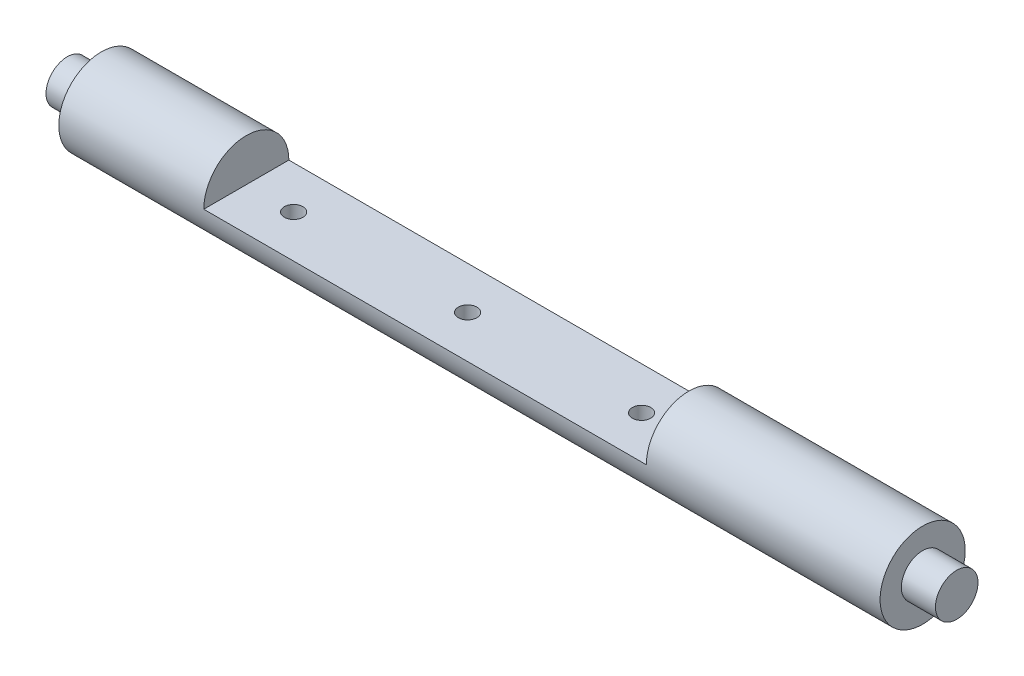
ISO-10303-21;
HEADER;
FILE_DESCRIPTION(('STEP AP214'),'2;1');
FILE_NAME('part.step','',(''),(''),'','','');
FILE_SCHEMA(('AUTOMOTIVE_DESIGN { 1 0 10303 214 1 1 1 1 }'));
ENDSEC;
DATA;
#1=APPLICATION_CONTEXT('core data for automotive mechanical design processes');
#2=APPLICATION_PROTOCOL_DEFINITION('international standard','automotive_design',2000,#1);
#3=PRODUCT_CONTEXT('',#1,'mechanical');
#4=PRODUCT('Part','Part','',(#3));
#5=PRODUCT_RELATED_PRODUCT_CATEGORY('part','',(#4));
#6=PRODUCT_DEFINITION_FORMATION('','',#4);
#7=PRODUCT_DEFINITION_CONTEXT('part definition',#1,'design');
#8=PRODUCT_DEFINITION('design','',#6,#7);
#9=PRODUCT_DEFINITION_SHAPE('','',#8);
#10=(LENGTH_UNIT() NAMED_UNIT(*) SI_UNIT(.MILLI.,.METRE.));
#11=(NAMED_UNIT(*) PLANE_ANGLE_UNIT() SI_UNIT($,.RADIAN.));
#12=(NAMED_UNIT(*) SI_UNIT($,.STERADIAN.) SOLID_ANGLE_UNIT());
#13=UNCERTAINTY_MEASURE_WITH_UNIT(LENGTH_MEASURE(1.E-05),#10,'distance_accuracy_value','');
#14=(GEOMETRIC_REPRESENTATION_CONTEXT(3) GLOBAL_UNCERTAINTY_ASSIGNED_CONTEXT((#13)) GLOBAL_UNIT_ASSIGNED_CONTEXT((#10,
#11,#12)) REPRESENTATION_CONTEXT('',''));
#15=CARTESIAN_POINT('',(0.,0.,0.));
#16=DIRECTION('',(0.,0.,1.));
#17=DIRECTION('',(1.,0.,0.));
#18=AXIS2_PLACEMENT_3D('',#15,#16,#17);
#19=CARTESIAN_POINT('',(76.581,0.,0.));
#20=DIRECTION('',(-1.,0.,0.));
#21=DIRECTION('',(0.,0.,1.));
#22=AXIS2_PLACEMENT_3D('',#19,#20,#21);
#23=CYLINDRICAL_SURFACE('',#22,7.9375);
#24=CARTESIAN_POINT('',(-10.0065800040059,-7.9375,0.));
#25=CARTESIAN_POINT('',(-10.0065767151243,-7.93749823123906,0.0958073881689647));
#26=CARTESIAN_POINT('',(-9.99858146935252,-7.93574773763831,0.19165463112775));
#27=CARTESIAN_POINT('',(-9.9668444467255,-7.92893373607812,0.380627437848213));
#28=CARTESIAN_POINT('',(-9.94309133910361,-7.9238678442009,0.473750992784546));
#29=CARTESIAN_POINT('',(-9.8806171352402,-7.91098719512658,0.654517984196976));
#30=CARTESIAN_POINT('',(-9.84191159355186,-7.90317529527451,0.742167005950524));
#31=CARTESIAN_POINT('',(-9.75068039778761,-7.88564613455322,0.909723685589422));
#32=CARTESIAN_POINT('',(-9.69815513016537,-7.87592892696579,0.989631559862106));
#33=CARTESIAN_POINT('',(-9.57989208350901,-7.8554813122122,1.14071073132594));
#34=CARTESIAN_POINT('',(-9.51397679143252,-7.84473844639551,1.21174139937617));
#35=CARTESIAN_POINT('',(-9.37118590814185,-7.82353826576888,1.34183058450905));
#36=CARTESIAN_POINT('',(-9.29430934866295,-7.81308097628268,1.40088804281957));
#37=CARTESIAN_POINT('',(-9.13074015734489,-7.7935131946505,1.50597348501262));
#38=CARTESIAN_POINT('',(-9.04394942713322,-7.78441867087501,1.5518520142041));
#39=CARTESIAN_POINT('',(-8.86365963280887,-7.76878483890527,1.62831867237904));
#40=CARTESIAN_POINT('',(-8.77016136344591,-7.76224522857938,1.65890860943666));
#41=CARTESIAN_POINT('',(-8.58063527568469,-7.75258849074546,1.70346549614084));
#42=CARTESIAN_POINT('',(-8.48466862342135,-7.74942018588862,1.71768129241553));
#43=CARTESIAN_POINT('',(-8.29166419484064,-7.7467110604534,1.72986006814803));
#44=CARTESIAN_POINT('',(-8.19462655021433,-7.74716979874229,1.72782502408532));
#45=CARTESIAN_POINT('',(-8.0040828266535,-7.75161658533984,1.70776020281199));
#46=CARTESIAN_POINT('',(-7.91054461910179,-7.75554089613587,1.69001926793962));
#47=CARTESIAN_POINT('',(-7.72780478730695,-7.76637590985053,1.63950377367332));
#48=CARTESIAN_POINT('',(-7.63860340442413,-7.77328677877098,1.60672837861301));
#49=CARTESIAN_POINT('',(-7.46625604509379,-7.78937918391717,1.52680845692339));
#50=CARTESIAN_POINT('',(-7.38316336941165,-7.79857819698601,1.4795526526897));
#51=CARTESIAN_POINT('',(-7.22598014850067,-7.81819964287655,1.37209159269287));
#52=CARTESIAN_POINT('',(-7.15189082054664,-7.82862224075623,1.31188458893721));
#53=CARTESIAN_POINT('',(-7.01315423113704,-7.8497901292963,1.17870011171349));
#54=CARTESIAN_POINT('',(-6.94874290242908,-7.86053755301087,1.10547696900436));
#55=CARTESIAN_POINT('',(-6.83307617795741,-7.88094098483664,0.949146705657934));
#56=CARTESIAN_POINT('',(-6.78182101577436,-7.89059697356831,0.86603940957114));
#57=CARTESIAN_POINT('',(-6.69386418895384,-7.90776040439147,0.69201359053357));
#58=CARTESIAN_POINT('',(-6.6571931932544,-7.91526330965628,0.601079090866865));
#59=CARTESIAN_POINT('',(-6.59971718739356,-7.92724143566355,0.414139308890615));
#60=CARTESIAN_POINT('',(-6.57890989429364,-7.93171709204561,0.318134758336966));
#61=CARTESIAN_POINT('',(-6.55409452743121,-7.93707451121609,0.125804084597236));
#62=CARTESIAN_POINT('',(-6.54976413010939,-7.93802521998525,0.0295214146921693));
#63=CARTESIAN_POINT('',(-6.55715218510755,-7.93641872364663,-0.162391579388377));
#64=CARTESIAN_POINT('',(-6.56886956067051,-7.93386175389344,-0.258021946898713));
#65=CARTESIAN_POINT('',(-6.60775324331464,-7.92557069335395,-0.444849540530765));
#66=CARTESIAN_POINT('',(-6.63475072004057,-7.91987134035831,-0.536083582859762));
#67=CARTESIAN_POINT('',(-6.70324103262945,-7.90593334051042,-0.712728334819324));
#68=CARTESIAN_POINT('',(-6.74473509464169,-7.89769447886854,-0.798138551128815));
#69=CARTESIAN_POINT('',(-6.84171389445993,-7.87942116984806,-0.96204563431249));
#70=CARTESIAN_POINT('',(-6.89738827972828,-7.86936296606737,-1.0404275853854));
#71=CARTESIAN_POINT('',(-7.0208973391711,-7.84861561400828,-1.186852002142));
#72=CARTESIAN_POINT('',(-7.08873357530267,-7.83792638480515,-1.25489313766934));
#73=CARTESIAN_POINT('',(-7.23611907250046,-7.81688394304775,-1.3799769256629));
#74=CARTESIAN_POINT('',(-7.31585929253473,-7.8065404064753,-1.43679650032908));
#75=CARTESIAN_POINT('',(-7.48393987712311,-7.78758313020685,-1.53623833452735));
#76=CARTESIAN_POINT('',(-7.57227987068798,-7.7789693159407,-1.57886120614654));
#77=CARTESIAN_POINT('',(-7.75457991992301,-7.76452846939796,-1.64841342423576));
#78=CARTESIAN_POINT('',(-7.848505150381,-7.75868586450804,-1.67543065695435));
#79=CARTESIAN_POINT('',(-8.0397056043045,-7.75042055627495,-1.71326275790442));
#80=CARTESIAN_POINT('',(-8.1369802959159,-7.74799731252034,-1.72408018644345));
#81=CARTESIAN_POINT('',(-8.32986978032324,-7.74687889875348,-1.72909752111868));
#82=CARTESIAN_POINT('',(-8.42547508494826,-7.74810439354014,-1.7236510486384));
#83=CARTESIAN_POINT('',(-8.61437070492887,-7.75396608736976,-1.69708510466239));
#84=CARTESIAN_POINT('',(-8.70766104697232,-7.75860224707428,-1.67596581393623));
#85=CARTESIAN_POINT('',(-8.88900116619458,-7.77072441574352,-1.61882377936269));
#86=CARTESIAN_POINT('',(-8.97706769601097,-7.77820067339822,-1.58285199436584));
#87=CARTESIAN_POINT('',(-9.14596837525763,-7.79516457788436,-1.49707004335149));
#88=CARTESIAN_POINT('',(-9.22680177900731,-7.80465243175721,-1.4472584527227));
#89=CARTESIAN_POINT('',(-9.38068596069133,-7.82480783773573,-1.33403578133058));
#90=CARTESIAN_POINT('',(-9.45354859972469,-7.83549519977694,-1.27037247419318));
#91=CARTESIAN_POINT('',(-9.58767258858405,-7.85671175612166,-1.13176529220538));
#92=CARTESIAN_POINT('',(-9.64893125420629,-7.86724091331228,-1.05681881453685));
#93=CARTESIAN_POINT('',(-9.75885905169366,-7.8871146306621,-0.896615921921775));
#94=CARTESIAN_POINT('',(-9.80735685214761,-7.89644228760263,-0.81123973085156));
#95=CARTESIAN_POINT('',(-9.88923717602942,-7.91269266690878,-0.63336299799249));
#96=CARTESIAN_POINT('',(-9.92263243533209,-7.91961741448107,-0.540868536319347));
#97=CARTESIAN_POINT('',(-9.96737564127575,-7.9290393225199,-0.373561939374604));
#98=CARTESIAN_POINT('',(-9.98204934225273,-7.93219249260771,-0.299658034136913));
#99=CARTESIAN_POINT('',(-10.0016526038123,-7.93642348104108,-0.150510913052046));
#100=CARTESIAN_POINT('',(-10.0065825878018,-7.93750138956576,-0.0752677555445906));
#101=CARTESIAN_POINT('',(-10.0065800040059,-7.9375,0.));
#102=B_SPLINE_CURVE_WITH_KNOTS('',3,(#24,#25,#26,#27,#28,#29,#30,#31,#32,#33,#34,#35,#36,#37,
#38,#39,#40,#41,#42,#43,#44,#45,#46,#47,#48,#49,#50,#51,#52,#53,#54,#55,#56,#57,#58,#59,#60,#61,
#62,#63,#64,#65,#66,#67,#68,#69,#70,#71,#72,#73,#74,#75,#76,#77,#78,#79,#80,#81,#82,#83,#84,#85,
#86,#87,#88,#89,#90,#91,#92,#93,#94,#95,#96,#97,#98,#99,#100,#101),.UNSPECIFIED.,.T.,.F.,(4,2,2,
2,2,2,2,2,2,2,2,2,2,2,2,2,2,2,2,2,2,2,2,2,2,2,2,2,2,2,2,2,2,2,2,2,2,2,4),(0.,0.287146664144719,
0.574500026604638,0.861555265748947,1.14860247855708,1.43973768043966,1.73089861573249,
2.02524168065782,2.31954992745943,2.6093238127633,2.89906245537194,3.18358079335433,
3.46811494774962,3.75489295700925,4.0417096963258,4.33466300802741,4.62762152059775,
4.92119287668271,5.21472197706307,5.50247858255768,5.79021588140078,6.07483434466128,
6.35947688733363,6.64814684314182,6.93685389967703,7.23082329647935,7.52478001722775,
7.81706470306558,8.10930318972206,8.39523421285749,8.68116193812877,8.96611669259424,
9.2511007899756,9.54178852762676,9.83254342458678,10.1270230391282,10.421253855724,
10.6468504884146,10.8724373177328),.UNSPECIFIED.);
#103=CARTESIAN_POINT('',(-10.0065800040059,-7.9375,0.));
#104=VERTEX_POINT('',#103);
#105=EDGE_CURVE('E149',#104,#104,#102,.T.);
#106=ORIENTED_EDGE('',*,*,#105,.T.);
#107=EDGE_LOOP('',(#106));
#108=FACE_BOUND('',#107,.T.);
#109=CARTESIAN_POINT('',(22.4334149919894,-7.9375,0.));
#110=CARTESIAN_POINT('',(22.4334182808711,-7.93749823123906,0.0958073881689647));
#111=CARTESIAN_POINT('',(22.4414135266428,-7.93574773763831,0.19165463112775));
#112=CARTESIAN_POINT('',(22.4731505492698,-7.92893373607812,0.380627437848212));
#113=CARTESIAN_POINT('',(22.4969036568917,-7.9238678442009,0.473750992784546));
#114=CARTESIAN_POINT('',(22.5593778607551,-7.91098719512658,0.654517984196974));
#115=CARTESIAN_POINT('',(22.5980834024435,-7.90317529527451,0.742167005950522));
#116=CARTESIAN_POINT('',(22.6893145982077,-7.88564613455322,0.909723685589418));
#117=CARTESIAN_POINT('',(22.74183986583,-7.87592892696579,0.989631559862102));
#118=CARTESIAN_POINT('',(22.8601029124863,-7.8554813122122,1.14071073132594));
#119=CARTESIAN_POINT('',(22.9260182045628,-7.84473844639551,1.21174139937616));
#120=CARTESIAN_POINT('',(23.0688090878535,-7.82353826576888,1.34183058450904));
#121=CARTESIAN_POINT('',(23.1456856473324,-7.81308097628268,1.40088804281957));
#122=CARTESIAN_POINT('',(23.3092548386505,-7.7935131946505,1.50597348501261));
#123=CARTESIAN_POINT('',(23.3960455688621,-7.78441867087501,1.55185201420409));
#124=CARTESIAN_POINT('',(23.5763353631865,-7.76878483890527,1.62831867237903));
#125=CARTESIAN_POINT('',(23.6698336325495,-7.76224522857938,1.65890860943665));
#126=CARTESIAN_POINT('',(23.8593597203107,-7.75258849074546,1.70346549614082));
#127=CARTESIAN_POINT('',(23.955326372574,-7.74942018588862,1.71768129241551));
#128=CARTESIAN_POINT('',(24.1483308011547,-7.7467110604534,1.72986006814801));
#129=CARTESIAN_POINT('',(24.245368445781,-7.7471697987423,1.7278250240853));
#130=CARTESIAN_POINT('',(24.4359121693419,-7.75161658533985,1.70776020281197));
#131=CARTESIAN_POINT('',(24.5294503768936,-7.75554089613588,1.6900192679396));
#132=CARTESIAN_POINT('',(24.7121902086884,-7.76637590985054,1.6395037736733));
#133=CARTESIAN_POINT('',(24.8013915915712,-7.77328677877098,1.60672837861298));
#134=CARTESIAN_POINT('',(24.9737389509016,-7.78937918391718,1.52680845692336));
#135=CARTESIAN_POINT('',(25.0568316265837,-7.79857819698602,1.47955265268967));
#136=CARTESIAN_POINT('',(25.2140148474947,-7.81819964287656,1.37209159269284));
#137=CARTESIAN_POINT('',(25.2881041754487,-7.82862224075623,1.31188458893717));
#138=CARTESIAN_POINT('',(25.4268407648583,-7.84979012929631,1.17870011171346));
#139=CARTESIAN_POINT('',(25.4912520935663,-7.86053755301087,1.10547696900433));
#140=CARTESIAN_POINT('',(25.6069188180379,-7.88094098483665,0.949146705657898));
#141=CARTESIAN_POINT('',(25.658173980221,-7.89059697356832,0.866039409571102));
#142=CARTESIAN_POINT('',(25.7461308070415,-7.90776040439147,0.69201359053353));
#143=CARTESIAN_POINT('',(25.782801802741,-7.91526330965628,0.601079090866825));
#144=CARTESIAN_POINT('',(25.8402778086018,-7.92724143566355,0.414139308890576));
#145=CARTESIAN_POINT('',(25.8610851017017,-7.93171709204561,0.318134758336926));
#146=CARTESIAN_POINT('',(25.8859004685641,-7.93707451121609,0.125804084597197));
#147=CARTESIAN_POINT('',(25.890230865886,-7.93802521998525,0.0295214146921293));
#148=CARTESIAN_POINT('',(25.8828428108878,-7.93641872364663,-0.162391579388417));
#149=CARTESIAN_POINT('',(25.8711254353248,-7.93386175389344,-0.258021946898753));
#150=CARTESIAN_POINT('',(25.8322417526807,-7.92557069335394,-0.444849540530805));
#151=CARTESIAN_POINT('',(25.8052442759548,-7.91987134035831,-0.536083582859802));
#152=CARTESIAN_POINT('',(25.7367539633659,-7.90593334051042,-0.712728334819363));
#153=CARTESIAN_POINT('',(25.6952599013536,-7.89769447886854,-0.798138551128854));
#154=CARTESIAN_POINT('',(25.5982811015354,-7.87942116984806,-0.962045634312529));
#155=CARTESIAN_POINT('',(25.542606716267,-7.86936296606736,-1.04042758538544));
#156=CARTESIAN_POINT('',(25.4190976568242,-7.84861561400827,-1.18685200214203));
#157=CARTESIAN_POINT('',(25.3512614206927,-7.83792638480515,-1.25489313766938));
#158=CARTESIAN_POINT('',(25.2038759234949,-7.81688394304775,-1.37997692566293));
#159=CARTESIAN_POINT('',(25.1241357034606,-7.8065404064753,-1.43679650032911));
#160=CARTESIAN_POINT('',(24.9560551188722,-7.78758313020685,-1.53623833452738));
#161=CARTESIAN_POINT('',(24.8677151253073,-7.77896931594069,-1.57886120614657));
#162=CARTESIAN_POINT('',(24.6854150760723,-7.76452846939796,-1.64841342423579));
#163=CARTESIAN_POINT('',(24.5914898456143,-7.75868586450803,-1.67543065695438));
#164=CARTESIAN_POINT('',(24.4002893916908,-7.75042055627494,-1.71326275790445));
#165=CARTESIAN_POINT('',(24.3030147000794,-7.74799731252033,-1.72408018644347));
#166=CARTESIAN_POINT('',(24.1101252156721,-7.74687889875348,-1.7290975211187));
#167=CARTESIAN_POINT('',(24.0145199110471,-7.74810439354014,-1.72365104863842));
#168=CARTESIAN_POINT('',(23.8256242910665,-7.75396608736976,-1.69708510466241));
#169=CARTESIAN_POINT('',(23.732333949023,-7.75860224707427,-1.67596581393624));
#170=CARTESIAN_POINT('',(23.5509938298007,-7.77072441574352,-1.6188237793627));
#171=CARTESIAN_POINT('',(23.4629272999844,-7.77820067339822,-1.58285199436586));
#172=CARTESIAN_POINT('',(23.2940266207377,-7.79516457788436,-1.49707004335151));
#173=CARTESIAN_POINT('',(23.213193216988,-7.80465243175721,-1.44725845272272));
#174=CARTESIAN_POINT('',(23.059309035304,-7.82480783773573,-1.33403578133059));
#175=CARTESIAN_POINT('',(22.9864463962706,-7.83549519977694,-1.27037247419319));
#176=CARTESIAN_POINT('',(22.8523224074113,-7.85671175612166,-1.13176529220539));
#177=CARTESIAN_POINT('',(22.791063741789,-7.86724091331228,-1.05681881453685));
#178=CARTESIAN_POINT('',(22.6811359443017,-7.8871146306621,-0.89661592192178));
#179=CARTESIAN_POINT('',(22.6326381438477,-7.89644228760263,-0.811239730851566));
#180=CARTESIAN_POINT('',(22.5507578199659,-7.91269266690878,-0.633362997992496));
#181=CARTESIAN_POINT('',(22.5173625606632,-7.91961741448107,-0.540868536319352));
#182=CARTESIAN_POINT('',(22.4726193547196,-7.9290393225199,-0.373561939374608));
#183=CARTESIAN_POINT('',(22.4579456537426,-7.93219249260771,-0.299658034136915));
#184=CARTESIAN_POINT('',(22.4383423921831,-7.93642348104108,-0.150510913052046));
#185=CARTESIAN_POINT('',(22.4334124081935,-7.93750138956576,-0.0752677555445907));
#186=CARTESIAN_POINT('',(22.4334149919894,-7.9375,0.));
#187=B_SPLINE_CURVE_WITH_KNOTS('',3,(#109,#110,#111,#112,#113,#114,#115,#116,#117,#118,#119,
#120,#121,#122,#123,#124,#125,#126,#127,#128,#129,#130,#131,#132,#133,#134,#135,#136,#137,#138,
#139,#140,#141,#142,#143,#144,#145,#146,#147,#148,#149,#150,#151,#152,#153,#154,#155,#156,#157,
#158,#159,#160,#161,#162,#163,#164,#165,#166,#167,#168,#169,#170,#171,#172,#173,#174,#175,#176,
#177,#178,#179,#180,#181,#182,#183,#184,#185,#186),.UNSPECIFIED.,.T.,.F.,(4,2,2,2,2,2,2,2,2,2,2,
2,2,2,2,2,2,2,2,2,2,2,2,2,2,2,2,2,2,2,2,2,2,2,2,2,2,2,4),(0.,0.287146664144719,
0.574500026604638,0.861555265748947,1.14860247855708,1.43973768043966,1.73089861573249,
2.02524168065783,2.31954992745944,2.60932381276329,2.89906245537194,3.18358079335432,
3.46811494774962,3.75489295700925,4.0417096963258,4.33466300802741,4.62762152059776,
4.92119287668271,5.21472197706307,5.50247858255768,5.79021588140078,6.07483434466128,
6.35947688733363,6.64814684314182,6.93685389967703,7.23082329647935,7.52478001722775,
7.81706470306559,8.10930318972207,8.39523421285749,8.68116193812877,8.96611669259424,
9.2511007899756,9.54178852762676,9.83254342458679,10.1270230391282,10.421253855724,
10.6468504884146,10.8724373177328),.UNSPECIFIED.);
#188=CARTESIAN_POINT('',(22.4334149919894,-7.9375,0.));
#189=VERTEX_POINT('',#188);
#190=EDGE_CURVE('E153',#189,#189,#187,.T.);
#191=ORIENTED_EDGE('',*,*,#190,.T.);
#192=EDGE_LOOP('',(#191));
#193=FACE_BOUND('',#192,.T.);
#194=CARTESIAN_POINT('',(-42.4465750000012,-7.9375,0.));
#195=CARTESIAN_POINT('',(-42.4465717111196,-7.93749823123906,0.0958073881689644));
#196=CARTESIAN_POINT('',(-42.4385764653479,-7.93574773763831,0.19165463112775));
#197=CARTESIAN_POINT('',(-42.4068394427208,-7.92893373607812,0.380627437848212));
#198=CARTESIAN_POINT('',(-42.383086335099,-7.9238678442009,0.473750992784545));
#199=CARTESIAN_POINT('',(-42.3206121312355,-7.91098719512658,0.654517984196974));
#200=CARTESIAN_POINT('',(-42.2819065895472,-7.90317529527451,0.742167005950522));
#201=CARTESIAN_POINT('',(-42.190675393783,-7.88564613455322,0.909723685589419));
#202=CARTESIAN_POINT('',(-42.1381501261607,-7.87592892696579,0.989631559862104));
#203=CARTESIAN_POINT('',(-42.0198870795044,-7.8554813122122,1.14071073132594));
#204=CARTESIAN_POINT('',(-41.9539717874279,-7.84473844639551,1.21174139937617));
#205=CARTESIAN_POINT('',(-41.8111809041372,-7.82353826576888,1.34183058450905));
#206=CARTESIAN_POINT('',(-41.7343043446583,-7.81308097628268,1.40088804281958));
#207=CARTESIAN_POINT('',(-41.5707351533402,-7.7935131946505,1.50597348501262));
#208=CARTESIAN_POINT('',(-41.4839444231286,-7.78441867087501,1.55185201420411));
#209=CARTESIAN_POINT('',(-41.3036546288042,-7.76878483890527,1.62831867237905));
#210=CARTESIAN_POINT('',(-41.2101563594413,-7.76224522857938,1.65890860943667));
#211=CARTESIAN_POINT('',(-41.02063027168,-7.75258849074545,1.70346549614085));
#212=CARTESIAN_POINT('',(-40.9246636194167,-7.74942018588862,1.71768129241554));
#213=CARTESIAN_POINT('',(-40.731659190836,-7.7467110604534,1.72986006814805));
#214=CARTESIAN_POINT('',(-40.6346215462097,-7.74716979874229,1.72782502408534));
#215=CARTESIAN_POINT('',(-40.4440778226489,-7.75161658533984,1.70776020281202));
#216=CARTESIAN_POINT('',(-40.3505396150972,-7.75554089613587,1.69001926793964));
#217=CARTESIAN_POINT('',(-40.1677997833023,-7.76637590985053,1.63950377367335));
#218=CARTESIAN_POINT('',(-40.0785984004195,-7.77328677877097,1.60672837861303));
#219=CARTESIAN_POINT('',(-39.9062510410891,-7.78937918391716,1.52680845692342));
#220=CARTESIAN_POINT('',(-39.823158365407,-7.79857819698601,1.47955265268973));
#221=CARTESIAN_POINT('',(-39.665975144496,-7.81819964287654,1.3720915926929));
#222=CARTESIAN_POINT('',(-39.591885816542,-7.82862224075622,1.31188458893724));
#223=CARTESIAN_POINT('',(-39.4531492271324,-7.8497901292963,1.17870011171352));
#224=CARTESIAN_POINT('',(-39.3887378984244,-7.86053755301086,1.10547696900439));
#225=CARTESIAN_POINT('',(-39.2730711739528,-7.88094098483664,0.949146705657968));
#226=CARTESIAN_POINT('',(-39.2218160117697,-7.89059697356831,0.866039409571176));
#227=CARTESIAN_POINT('',(-39.1338591849492,-7.90776040439147,0.692013590533608));
#228=CARTESIAN_POINT('',(-39.0971881892497,-7.91526330965628,0.601079090866904));
#229=CARTESIAN_POINT('',(-39.0397121833889,-7.92724143566354,0.414139308890656));
#230=CARTESIAN_POINT('',(-39.018904890289,-7.93171709204561,0.318134758337006));
#231=CARTESIAN_POINT('',(-38.9940895234265,-7.93707451121609,0.125804084597277));
#232=CARTESIAN_POINT('',(-38.9897591261047,-7.93802521998525,0.0295214146922098));
#233=CARTESIAN_POINT('',(-38.9971471811029,-7.93641872364663,-0.162391579388337));
#234=CARTESIAN_POINT('',(-39.0088645566658,-7.93386175389344,-0.258021946898674));
#235=CARTESIAN_POINT('',(-39.04774823931,-7.92557069335395,-0.444849540530727));
#236=CARTESIAN_POINT('',(-39.0747457160359,-7.91987134035831,-0.536083582859724));
#237=CARTESIAN_POINT('',(-39.1432360286248,-7.90593334051042,-0.712728334819287));
#238=CARTESIAN_POINT('',(-39.184730090637,-7.89769447886854,-0.798138551128779));
#239=CARTESIAN_POINT('',(-39.2817088904553,-7.87942116984807,-0.962045634312455));
#240=CARTESIAN_POINT('',(-39.3373832757236,-7.86936296606737,-1.04042758538536));
#241=CARTESIAN_POINT('',(-39.4608923351664,-7.84861561400828,-1.18685200214196));
#242=CARTESIAN_POINT('',(-39.528728571298,-7.83792638480516,-1.25489313766931));
#243=CARTESIAN_POINT('',(-39.6761140684958,-7.81688394304776,-1.37997692566287));
#244=CARTESIAN_POINT('',(-39.75585428853,-7.80654040647531,-1.43679650032905));
#245=CARTESIAN_POINT('',(-39.9239348731184,-7.78758313020686,-1.53623833452732));
#246=CARTESIAN_POINT('',(-40.0122748666833,-7.7789693159407,-1.57886120614651));
#247=CARTESIAN_POINT('',(-40.1945749159183,-7.76452846939797,-1.64841342423574));
#248=CARTESIAN_POINT('',(-40.2885001463763,-7.75868586450805,-1.67543065695432));
#249=CARTESIAN_POINT('',(-40.4797006002998,-7.75042055627495,-1.7132627579044));
#250=CARTESIAN_POINT('',(-40.5769752919112,-7.74799731252035,-1.72408018644343));
#251=CARTESIAN_POINT('',(-40.7698647763186,-7.74687889875349,-1.72909752111866));
#252=CARTESIAN_POINT('',(-40.8654700809436,-7.74810439354014,-1.72365104863839));
#253=CARTESIAN_POINT('',(-41.0543657009242,-7.75396608736977,-1.69708510466238));
#254=CARTESIAN_POINT('',(-41.1476560429676,-7.75860224707428,-1.67596581393621));
#255=CARTESIAN_POINT('',(-41.3289961621899,-7.77072441574352,-1.61882377936268));
#256=CARTESIAN_POINT('',(-41.4170626920063,-7.77820067339822,-1.58285199436583));
#257=CARTESIAN_POINT('',(-41.585963371253,-7.79516457788436,-1.49707004335149));
#258=CARTESIAN_POINT('',(-41.6667967750026,-7.80465243175721,-1.4472584527227));
#259=CARTESIAN_POINT('',(-41.8206809566866,-7.82480783773573,-1.33403578133058));
#260=CARTESIAN_POINT('',(-41.89354359572,-7.83549519977694,-1.27037247419317));
#261=CARTESIAN_POINT('',(-42.0276675845794,-7.85671175612166,-1.13176529220538));
#262=CARTESIAN_POINT('',(-42.0889262502016,-7.86724091331228,-1.05681881453685));
#263=CARTESIAN_POINT('',(-42.198854047689,-7.8871146306621,-0.896615921921775));
#264=CARTESIAN_POINT('',(-42.2473518481429,-7.89644228760263,-0.811239730851559));
#265=CARTESIAN_POINT('',(-42.3292321720248,-7.91269266690878,-0.63336299799249));
#266=CARTESIAN_POINT('',(-42.3626274313274,-7.91961741448107,-0.540868536319349));
#267=CARTESIAN_POINT('',(-42.4073706372711,-7.9290393225199,-0.373561939374607));
#268=CARTESIAN_POINT('',(-42.4220443382481,-7.93219249260771,-0.299658034136915));
#269=CARTESIAN_POINT('',(-42.4416475998076,-7.93642348104108,-0.150510913052046));
#270=CARTESIAN_POINT('',(-42.4465775837971,-7.93750138956576,-0.0752677555445907));
#271=CARTESIAN_POINT('',(-42.4465750000012,-7.9375,0.));
#272=B_SPLINE_CURVE_WITH_KNOTS('',3,(#194,#195,#196,#197,#198,#199,#200,#201,#202,#203,#204,
#205,#206,#207,#208,#209,#210,#211,#212,#213,#214,#215,#216,#217,#218,#219,#220,#221,#222,#223,
#224,#225,#226,#227,#228,#229,#230,#231,#232,#233,#234,#235,#236,#237,#238,#239,#240,#241,#242,
#243,#244,#245,#246,#247,#248,#249,#250,#251,#252,#253,#254,#255,#256,#257,#258,#259,#260,#261,
#262,#263,#264,#265,#266,#267,#268,#269,#270,#271),.UNSPECIFIED.,.T.,.F.,(4,2,2,2,2,2,2,2,2,2,2,
2,2,2,2,2,2,2,2,2,2,2,2,2,2,2,2,2,2,2,2,2,2,2,2,2,2,2,4),(0.,0.287146664144718,
0.574500026604636,0.86155526574894,1.14860247855708,1.43973768043966,1.73089861573249,
2.02524168065782,2.31954992745943,2.60932381276329,2.89906245537194,3.18358079335432,
3.46811494774961,3.75489295700924,4.0417096963258,4.33466300802741,4.62762152059775,
4.92119287668271,5.21472197706307,5.50247858255768,5.79021588140078,6.07483434466127,
6.35947688733362,6.64814684314182,6.93685389967702,7.23082329647934,7.52478001722774,
7.81706470306557,8.10930318972205,8.39523421285748,8.68116193812877,8.96611669259423,
9.2511007899756,9.54178852762676,9.83254342458679,10.1270230391282,10.421253855724,
10.6468504884146,10.8724373177328),.UNSPECIFIED.);
#273=CARTESIAN_POINT('',(-42.4465750000012,-7.9375,0.));
#274=VERTEX_POINT('',#273);
#275=EDGE_CURVE('E69',#274,#274,#272,.T.);
#276=ORIENTED_EDGE('',*,*,#275,.T.);
#277=EDGE_LOOP('',(#276));
#278=FACE_BOUND('',#277,.T.);
#279=CARTESIAN_POINT('',(-76.581,0.,0.));
#280=DIRECTION('',(1.,0.,0.));
#281=DIRECTION('',(0.,0.,-1.));
#282=AXIS2_PLACEMENT_3D('',#279,#280,#281);
#283=CIRCLE('',#282,7.9375);
#284=CARTESIAN_POINT('',(-76.581,0.,-7.9375));
#285=VERTEX_POINT('',#284);
#286=EDGE_CURVE('E76',#285,#285,#283,.T.);
#287=ORIENTED_EDGE('',*,*,#286,.T.);
#288=EDGE_LOOP('',(#287));
#289=FACE_BOUND('',#288,.T.);
#290=CARTESIAN_POINT('',(76.581,0.,0.));
#291=DIRECTION('',(1.,0.,0.));
#292=DIRECTION('',(0.,0.,-1.));
#293=AXIS2_PLACEMENT_3D('',#290,#291,#292);
#294=CIRCLE('',#293,7.9375);
#295=CARTESIAN_POINT('',(76.581,0.,-7.9375));
#296=VERTEX_POINT('',#295);
#297=EDGE_CURVE('E75',#296,#296,#294,.T.);
#298=ORIENTED_EDGE('',*,*,#297,.F.);
#299=EDGE_LOOP('',(#298));
#300=FACE_BOUND('',#299,.T.);
#301=DIRECTION('',(-1.,0.,0.));
#302=VECTOR('',#301,1.);
#303=CARTESIAN_POINT('',(76.581,0.,7.9375));
#304=LINE('',#303,#302);
#305=CARTESIAN_POINT('',(32.9871149919898,0.,7.9375));
#306=VERTEX_POINT('',#305);
#307=CARTESIAN_POINT('',(-49.5458750000009,0.,7.9375));
#308=VERTEX_POINT('',#307);
#309=EDGE_CURVE('E11',#306,#308,#304,.T.);
#310=ORIENTED_EDGE('',*,*,#309,.T.);
#311=CARTESIAN_POINT('',(-49.5458750000009,0.,0.));
#312=DIRECTION('',(1.,0.,0.));
#313=DIRECTION('',(0.,0.,-1.));
#314=AXIS2_PLACEMENT_3D('',#311,#312,#313);
#315=CIRCLE('',#314,7.9375);
#316=CARTESIAN_POINT('',(-49.5458750000009,0.,-7.9375));
#317=VERTEX_POINT('',#316);
#318=EDGE_CURVE('E41',#317,#308,#315,.T.);
#319=ORIENTED_EDGE('',*,*,#318,.F.);
#320=DIRECTION('',(-1.,0.,0.));
#321=VECTOR('',#320,1.);
#322=CARTESIAN_POINT('',(76.581,0.,-7.9375));
#323=LINE('',#322,#321);
#324=CARTESIAN_POINT('',(32.9871149919898,0.,-7.9375));
#325=VERTEX_POINT('',#324);
#326=EDGE_CURVE('E60',#317,#325,#323,.F.);
#327=ORIENTED_EDGE('',*,*,#326,.T.);
#328=CARTESIAN_POINT('',(32.9871149919898,0.,0.));
#329=DIRECTION('',(-1.,0.,0.));
#330=DIRECTION('',(0.,0.,1.));
#331=AXIS2_PLACEMENT_3D('',#328,#329,#330);
#332=CIRCLE('',#331,7.9375);
#333=EDGE_CURVE('E54',#306,#325,#332,.T.);
#334=ORIENTED_EDGE('',*,*,#333,.F.);
#335=EDGE_LOOP('',(#310,#319,#327,#334));
#336=FACE_BOUND('',#335,.T.);
#337=ADVANCED_FACE('F33',(#108,#193,#278,#289,#300,#336),#23,.T.);
#338=CARTESIAN_POINT('',(76.581,0.,0.));
#339=DIRECTION('',(1.,0.,0.));
#340=DIRECTION('',(0.,0.,-1.));
#341=AXIS2_PLACEMENT_3D('',#338,#339,#340);
#342=PLANE('',#341);
#343=CARTESIAN_POINT('',(76.581,0.,0.));
#344=DIRECTION('',(1.,0.,0.));
#345=DIRECTION('',(0.,0.,-1.));
#346=AXIS2_PLACEMENT_3D('',#343,#344,#345);
#347=CIRCLE('',#346,3.96875);
#348=CARTESIAN_POINT('',(76.581,0.,-3.96875));
#349=VERTEX_POINT('',#348);
#350=EDGE_CURVE('E85',#349,#349,#347,.T.);
#351=ORIENTED_EDGE('',*,*,#350,.F.);
#352=EDGE_LOOP('',(#351));
#353=FACE_BOUND('',#352,.T.);
#354=ORIENTED_EDGE('',*,*,#297,.T.);
#355=EDGE_LOOP('',(#354));
#356=FACE_BOUND('',#355,.T.);
#357=ADVANCED_FACE('F133',(#353,#356),#342,.T.);
#358=CARTESIAN_POINT('',(-76.581,0.,0.));
#359=DIRECTION('',(1.,0.,0.));
#360=DIRECTION('',(0.,0.,-1.));
#361=AXIS2_PLACEMENT_3D('',#358,#359,#360);
#362=PLANE('',#361);
#363=CARTESIAN_POINT('',(-76.581,0.,0.));
#364=DIRECTION('',(1.,0.,0.));
#365=DIRECTION('',(0.,0.,-1.));
#366=AXIS2_PLACEMENT_3D('',#363,#364,#365);
#367=CIRCLE('',#366,3.96875);
#368=CARTESIAN_POINT('',(-76.581,0.,-3.96875));
#369=VERTEX_POINT('',#368);
#370=EDGE_CURVE('E65',#369,#369,#367,.F.);
#371=ORIENTED_EDGE('',*,*,#370,.F.);
#372=EDGE_LOOP('',(#371));
#373=FACE_BOUND('',#372,.T.);
#374=ORIENTED_EDGE('',*,*,#286,.F.);
#375=EDGE_LOOP('',(#374));
#376=FACE_BOUND('',#375,.T.);
#377=ADVANCED_FACE('F131',(#373,#376),#362,.F.);
#378=CARTESIAN_POINT('',(-82.931,0.,0.));
#379=DIRECTION('',(1.,0.,0.));
#380=DIRECTION('',(0.,0.,-1.));
#381=AXIS2_PLACEMENT_3D('',#378,#379,#380);
#382=CYLINDRICAL_SURFACE('',#381,3.96875);
#383=CARTESIAN_POINT('',(-82.931,0.,0.));
#384=DIRECTION('',(-1.,0.,0.));
#385=DIRECTION('',(0.,0.,1.));
#386=AXIS2_PLACEMENT_3D('',#383,#384,#385);
#387=CIRCLE('',#386,3.96875);
#388=CARTESIAN_POINT('',(-82.931,0.,3.96875));
#389=VERTEX_POINT('',#388);
#390=EDGE_CURVE('E79',#389,#389,#387,.T.);
#391=ORIENTED_EDGE('',*,*,#390,.F.);
#392=EDGE_LOOP('',(#391));
#393=FACE_BOUND('',#392,.T.);
#394=ORIENTED_EDGE('',*,*,#370,.T.);
#395=EDGE_LOOP('',(#394));
#396=FACE_BOUND('',#395,.T.);
#397=ADVANCED_FACE('F127',(#393,#396),#382,.T.);
#398=CARTESIAN_POINT('',(-82.931,0.,0.));
#399=DIRECTION('',(-1.,0.,0.));
#400=DIRECTION('',(0.,0.,1.));
#401=AXIS2_PLACEMENT_3D('',#398,#399,#400);
#402=PLANE('',#401);
#403=ORIENTED_EDGE('',*,*,#390,.T.);
#404=EDGE_LOOP('',(#403));
#405=FACE_BOUND('',#404,.T.);
#406=ADVANCED_FACE('F123',(#405),#402,.T.);
#407=CARTESIAN_POINT('',(82.931,0.,0.));
#408=DIRECTION('',(-1.,0.,0.));
#409=DIRECTION('',(0.,0.,1.));
#410=AXIS2_PLACEMENT_3D('',#407,#408,#409);
#411=CYLINDRICAL_SURFACE('',#410,3.96875);
#412=CARTESIAN_POINT('',(82.931,0.,0.));
#413=DIRECTION('',(1.,0.,0.));
#414=DIRECTION('',(0.,0.,-1.));
#415=AXIS2_PLACEMENT_3D('',#412,#413,#414);
#416=CIRCLE('',#415,3.96875);
#417=CARTESIAN_POINT('',(82.931,0.,-3.96875));
#418=VERTEX_POINT('',#417);
#419=EDGE_CURVE('E84',#418,#418,#416,.T.);
#420=ORIENTED_EDGE('',*,*,#419,.F.);
#421=EDGE_LOOP('',(#420));
#422=FACE_BOUND('',#421,.T.);
#423=ORIENTED_EDGE('',*,*,#350,.T.);
#424=EDGE_LOOP('',(#423));
#425=FACE_BOUND('',#424,.T.);
#426=ADVANCED_FACE('F119',(#422,#425),#411,.T.);
#427=CARTESIAN_POINT('',(82.931,0.,0.));
#428=DIRECTION('',(1.,0.,0.));
#429=DIRECTION('',(0.,0.,-1.));
#430=AXIS2_PLACEMENT_3D('',#427,#428,#429);
#431=PLANE('',#430);
#432=ORIENTED_EDGE('',*,*,#419,.T.);
#433=EDGE_LOOP('',(#432));
#434=FACE_BOUND('',#433,.T.);
#435=ADVANCED_FACE('F116',(#434),#431,.T.);
#436=CARTESIAN_POINT('',(-49.5458750000009,7.9375,-12.7));
#437=DIRECTION('',(1.,0.,0.));
#438=DIRECTION('',(0.,0.,-1.));
#439=AXIS2_PLACEMENT_3D('',#436,#437,#438);
#440=PLANE('',#439);
#441=ORIENTED_EDGE('',*,*,#318,.T.);
#442=DIRECTION('',(0.,0.,1.));
#443=VECTOR('',#442,1.);
#444=CARTESIAN_POINT('',(-49.5458750000009,0.,-12.7));
#445=LINE('',#444,#443);
#446=EDGE_CURVE('E63',#317,#308,#445,.T.);
#447=ORIENTED_EDGE('',*,*,#446,.F.);
#448=EDGE_LOOP('',(#441,#447));
#449=FACE_BOUND('',#448,.T.);
#450=ADVANCED_FACE('F68',(#449),#440,.T.);
#451=CARTESIAN_POINT('',(32.9871149919898,7.9375,-12.7));
#452=DIRECTION('',(-1.,0.,0.));
#453=DIRECTION('',(0.,0.,1.));
#454=AXIS2_PLACEMENT_3D('',#451,#452,#453);
#455=PLANE('',#454);
#456=DIRECTION('',(0.,0.,-1.));
#457=VECTOR('',#456,1.);
#458=CARTESIAN_POINT('',(32.9871149919898,0.,-12.7));
#459=LINE('',#458,#457);
#460=EDGE_CURVE('E48',#306,#325,#459,.T.);
#461=ORIENTED_EDGE('',*,*,#460,.F.);
#462=ORIENTED_EDGE('',*,*,#333,.T.);
#463=EDGE_LOOP('',(#461,#462));
#464=FACE_BOUND('',#463,.T.);
#465=ADVANCED_FACE('F109',(#464),#455,.T.);
#466=CARTESIAN_POINT('',(0.,0.,0.));
#467=DIRECTION('',(0.,-1.,0.));
#468=DIRECTION('',(0.,0.,-1.));
#469=AXIS2_PLACEMENT_3D('',#466,#467,#468);
#470=PLANE('',#469);
#471=CARTESIAN_POINT('',(-8.27938000400589,0.,0.));
#472=DIRECTION('',(0.,1.,0.));
#473=DIRECTION('',(0.,0.,1.));
#474=AXIS2_PLACEMENT_3D('',#471,#472,#473);
#475=CIRCLE('',#474,1.7272);
#476=CARTESIAN_POINT('',(-8.27938000400589,0.,1.72720000000001));
#477=VERTEX_POINT('',#476);
#478=EDGE_CURVE('E162',#477,#477,#475,.T.);
#479=ORIENTED_EDGE('',*,*,#478,.F.);
#480=EDGE_LOOP('',(#479));
#481=FACE_BOUND('',#480,.T.);
#482=CARTESIAN_POINT('',(24.1606149919894,0.,0.));
#483=DIRECTION('',(0.,1.,0.));
#484=DIRECTION('',(0.,0.,1.));
#485=AXIS2_PLACEMENT_3D('',#482,#483,#484);
#486=CIRCLE('',#485,1.7272);
#487=CARTESIAN_POINT('',(24.1606149919894,0.,1.72719999999999));
#488=VERTEX_POINT('',#487);
#489=EDGE_CURVE('E165',#488,#488,#486,.T.);
#490=ORIENTED_EDGE('',*,*,#489,.F.);
#491=EDGE_LOOP('',(#490));
#492=FACE_BOUND('',#491,.T.);
#493=CARTESIAN_POINT('',(-40.7193750000012,0.,0.));
#494=DIRECTION('',(0.,1.,0.));
#495=DIRECTION('',(0.,0.,1.));
#496=AXIS2_PLACEMENT_3D('',#493,#494,#495);
#497=CIRCLE('',#496,1.7272);
#498=CARTESIAN_POINT('',(-40.7193750000012,0.,1.72720000000003));
#499=VERTEX_POINT('',#498);
#500=EDGE_CURVE('E96',#499,#499,#497,.T.);
#501=ORIENTED_EDGE('',*,*,#500,.F.);
#502=EDGE_LOOP('',(#501));
#503=FACE_BOUND('',#502,.T.);
#504=ORIENTED_EDGE('',*,*,#460,.T.);
#505=ORIENTED_EDGE('',*,*,#326,.F.);
#506=ORIENTED_EDGE('',*,*,#446,.T.);
#507=ORIENTED_EDGE('',*,*,#309,.F.);
#508=EDGE_LOOP('',(#504,#505,#506,#507));
#509=FACE_BOUND('',#508,.T.);
#510=ADVANCED_FACE('F62',(#481,#492,#503,#509),#470,.F.);
#511=CARTESIAN_POINT('',(-40.7193750000012,-7.9375,0.));
#512=DIRECTION('',(0.,1.,0.));
#513=DIRECTION('',(0.,0.,1.));
#514=AXIS2_PLACEMENT_3D('',#511,#512,#513);
#515=CYLINDRICAL_SURFACE('',#514,1.7272);
#516=ORIENTED_EDGE('',*,*,#500,.T.);
#517=EDGE_LOOP('',(#516));
#518=FACE_BOUND('',#517,.T.);
#519=ORIENTED_EDGE('',*,*,#275,.F.);
#520=EDGE_LOOP('',(#519));
#521=FACE_BOUND('',#520,.T.);
#522=ADVANCED_FACE('F98',(#518,#521),#515,.F.);
#523=CARTESIAN_POINT('',(24.1606149919894,-7.9375,0.));
#524=DIRECTION('',(0.,1.,0.));
#525=DIRECTION('',(0.,0.,1.));
#526=AXIS2_PLACEMENT_3D('',#523,#524,#525);
#527=CYLINDRICAL_SURFACE('',#526,1.7272);
#528=ORIENTED_EDGE('',*,*,#489,.T.);
#529=EDGE_LOOP('',(#528));
#530=FACE_BOUND('',#529,.T.);
#531=ORIENTED_EDGE('',*,*,#190,.F.);
#532=EDGE_LOOP('',(#531));
#533=FACE_BOUND('',#532,.T.);
#534=ADVANCED_FACE('F103',(#530,#533),#527,.F.);
#535=CARTESIAN_POINT('',(-8.27938000400589,-7.9375,0.));
#536=DIRECTION('',(0.,1.,0.));
#537=DIRECTION('',(0.,0.,1.));
#538=AXIS2_PLACEMENT_3D('',#535,#536,#537);
#539=CYLINDRICAL_SURFACE('',#538,1.7272);
#540=ORIENTED_EDGE('',*,*,#478,.T.);
#541=EDGE_LOOP('',(#540));
#542=FACE_BOUND('',#541,.T.);
#543=ORIENTED_EDGE('',*,*,#105,.F.);
#544=EDGE_LOOP('',(#543));
#545=FACE_BOUND('',#544,.T.);
#546=ADVANCED_FACE('F172',(#542,#545),#539,.F.);
#547=CLOSED_SHELL('',(#337,#357,#377,#397,#406,#426,#435,#450,#465,#510,#522,#534,#546));
#548=MANIFOLD_SOLID_BREP('B2',#547);
#549=ADVANCED_BREP_SHAPE_REPRESENTATION('',(#18,#548),#14);
#550=SHAPE_DEFINITION_REPRESENTATION(#9,#549);
ENDSEC;
END-ISO-10303-21;
